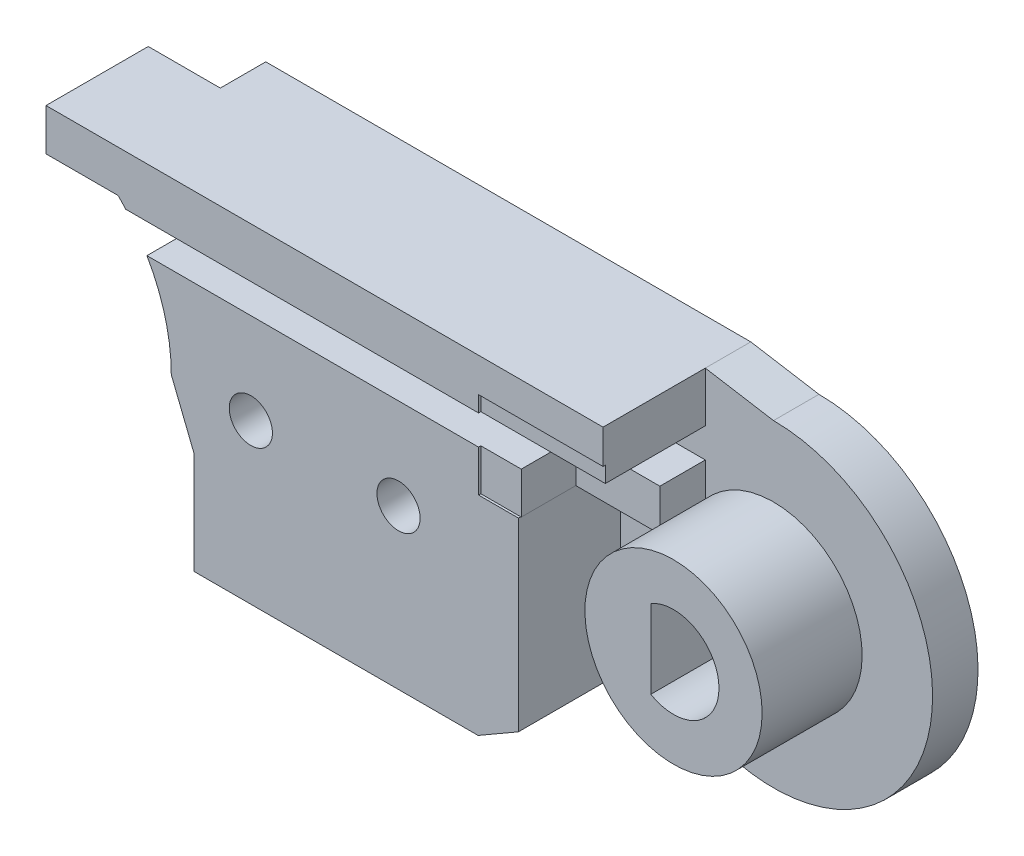
ISO-10303-21;
HEADER;
FILE_DESCRIPTION(('STEP AP214'),'2;1');
FILE_NAME('part.step','',(''),(''),'','','');
FILE_SCHEMA(('AUTOMOTIVE_DESIGN { 1 0 10303 214 1 1 1 1 }'));
ENDSEC;
DATA;
#1=APPLICATION_CONTEXT('core data for automotive mechanical design processes');
#2=APPLICATION_PROTOCOL_DEFINITION('international standard','automotive_design',2000,#1);
#3=PRODUCT_CONTEXT('',#1,'mechanical');
#4=PRODUCT('Part','Part','',(#3));
#5=PRODUCT_RELATED_PRODUCT_CATEGORY('part','',(#4));
#6=PRODUCT_DEFINITION_FORMATION('','',#4);
#7=PRODUCT_DEFINITION_CONTEXT('part definition',#1,'design');
#8=PRODUCT_DEFINITION('design','',#6,#7);
#9=PRODUCT_DEFINITION_SHAPE('','',#8);
#10=(LENGTH_UNIT() NAMED_UNIT(*) SI_UNIT(.MILLI.,.METRE.));
#11=(NAMED_UNIT(*) PLANE_ANGLE_UNIT() SI_UNIT($,.RADIAN.));
#12=(NAMED_UNIT(*) SI_UNIT($,.STERADIAN.) SOLID_ANGLE_UNIT());
#13=UNCERTAINTY_MEASURE_WITH_UNIT(LENGTH_MEASURE(1.E-05),#10,'distance_accuracy_value','');
#14=(GEOMETRIC_REPRESENTATION_CONTEXT(3) GLOBAL_UNCERTAINTY_ASSIGNED_CONTEXT((#13)) GLOBAL_UNIT_ASSIGNED_CONTEXT((#10,
#11,#12)) REPRESENTATION_CONTEXT('',''));
#15=CARTESIAN_POINT('',(0.,0.,0.));
#16=DIRECTION('',(0.,0.,1.));
#17=DIRECTION('',(1.,0.,0.));
#18=AXIS2_PLACEMENT_3D('',#15,#16,#17);
#19=CARTESIAN_POINT('',(0.,0.,6.5));
#20=DIRECTION('',(0.,0.,1.));
#21=DIRECTION('',(1.,0.,0.));
#22=AXIS2_PLACEMENT_3D('',#19,#20,#21);
#23=PLANE('',#22);
#24=DIRECTION('',(0.,-1.,0.));
#25=VECTOR('',#24,1.);
#26=CARTESIAN_POINT('',(21.5203540034992,0.,6.5));
#27=LINE('',#26,#25);
#28=CARTESIAN_POINT('',(21.5203540034992,6.,6.5));
#29=VERTEX_POINT('',#28);
#30=CARTESIAN_POINT('',(21.5203540034992,5.3,6.5));
#31=VERTEX_POINT('',#30);
#32=EDGE_CURVE('E341',#29,#31,#27,.T.);
#33=ORIENTED_EDGE('',*,*,#32,.F.);
#34=DIRECTION('',(-1.,0.,0.));
#35=VECTOR('',#34,1.);
#36=CARTESIAN_POINT('',(0.,6.,6.5));
#37=LINE('',#36,#35);
#38=CARTESIAN_POINT('',(27.,6.,6.5));
#39=VERTEX_POINT('',#38);
#40=EDGE_CURVE('E52',#39,#29,#37,.T.);
#41=ORIENTED_EDGE('',*,*,#40,.F.);
#42=DIRECTION('',(0.,1.,0.));
#43=VECTOR('',#42,1.);
#44=CARTESIAN_POINT('',(27.,7.5,6.5));
#45=LINE('',#44,#43);
#46=CARTESIAN_POINT('',(27.,7.5,6.5));
#47=VERTEX_POINT('',#46);
#48=EDGE_CURVE('E401',#39,#47,#45,.T.);
#49=ORIENTED_EDGE('',*,*,#48,.T.);
#50=DIRECTION('',(-1.,0.,0.));
#51=VECTOR('',#50,1.);
#52=CARTESIAN_POINT('',(21.5,7.5,6.5));
#53=LINE('',#52,#51);
#54=CARTESIAN_POINT('',(2.48679014755027,7.5,6.5));
#55=VERTEX_POINT('',#54);
#56=EDGE_CURVE('E404',#47,#55,#53,.T.);
#57=ORIENTED_EDGE('',*,*,#56,.T.);
#58=DIRECTION('',(0.,-1.,0.));
#59=VECTOR('',#58,1.);
#60=CARTESIAN_POINT('',(2.48679014755027,7.5,6.5));
#61=LINE('',#60,#59);
#62=CARTESIAN_POINT('',(2.48679014755027,5.65685424949238,6.5));
#63=VERTEX_POINT('',#62);
#64=EDGE_CURVE('E407',#55,#63,#61,.T.);
#65=ORIENTED_EDGE('',*,*,#64,.T.);
#66=DIRECTION('',(1.,0.,0.));
#67=VECTOR('',#66,1.);
#68=CARTESIAN_POINT('',(5.65685424949238,5.65685424949238,6.5));
#69=LINE('',#68,#67);
#70=CARTESIAN_POINT('',(5.65685424949238,5.65685424949238,6.5));
#71=VERTEX_POINT('',#70);
#72=EDGE_CURVE('E410',#63,#71,#69,.T.);
#73=ORIENTED_EDGE('',*,*,#72,.T.);
#74=CARTESIAN_POINT('',(0.,0.,6.5));
#75=DIRECTION('',(0.,0.,-1.));
#76=DIRECTION('',(1.,0.,0.));
#77=AXIS2_PLACEMENT_3D('',#74,#75,#76);
#78=CIRCLE('',#77,8.);
#79=CARTESIAN_POINT('',(5.99249530663145,5.3,6.5));
#80=VERTEX_POINT('',#79);
#81=EDGE_CURVE('E377',#71,#80,#78,.T.);
#82=ORIENTED_EDGE('',*,*,#81,.T.);
#83=DIRECTION('',(-1.,0.,0.));
#84=VECTOR('',#83,1.);
#85=CARTESIAN_POINT('',(18.0980804477077,5.3,6.5));
#86=LINE('',#85,#84);
#87=EDGE_CURVE('E348',#31,#80,#86,.T.);
#88=ORIENTED_EDGE('',*,*,#87,.F.);
#89=EDGE_LOOP('',(#33,#41,#49,#57,#65,#73,#82,#88));
#90=FACE_BOUND('',#89,.T.);
#91=ADVANCED_FACE('F42',(#90),#23,.T.);
#92=CARTESIAN_POINT('',(30.,0.,6.4));
#93=DIRECTION('',(0.,0.,1.));
#94=DIRECTION('',(1.,0.,0.));
#95=AXIS2_PLACEMENT_3D('',#92,#93,#94);
#96=PLANE('',#95);
#97=CARTESIAN_POINT('',(30.,0.,6.4));
#98=DIRECTION('',(0.,0.,1.));
#99=DIRECTION('',(1.,0.,0.));
#100=AXIS2_PLACEMENT_3D('',#97,#98,#99);
#101=CIRCLE('',#100,1.99999999999999);
#102=CARTESIAN_POINT('',(29.,-1.73205080756886,6.4));
#103=VERTEX_POINT('',#102);
#104=CARTESIAN_POINT('',(29.,1.73205080756886,6.4));
#105=VERTEX_POINT('',#104);
#106=EDGE_CURVE('E65',#103,#105,#101,.T.);
#107=ORIENTED_EDGE('',*,*,#106,.F.);
#108=DIRECTION('',(0.,-1.,0.));
#109=VECTOR('',#108,1.);
#110=CARTESIAN_POINT('',(29.,1.73205080756886,6.4));
#111=LINE('',#110,#109);
#112=EDGE_CURVE('E253',#105,#103,#111,.T.);
#113=ORIENTED_EDGE('',*,*,#112,.F.);
#114=EDGE_LOOP('',(#107,#113));
#115=FACE_BOUND('',#114,.T.);
#116=CARTESIAN_POINT('',(30.,0.,6.4));
#117=DIRECTION('',(0.,0.,1.));
#118=DIRECTION('',(1.,0.,0.));
#119=AXIS2_PLACEMENT_3D('',#116,#117,#118);
#120=CIRCLE('',#119,3.89999999999999);
#121=CARTESIAN_POINT('',(33.9,0.,6.4));
#122=VERTEX_POINT('',#121);
#123=EDGE_CURVE('E266',#122,#122,#120,.T.);
#124=ORIENTED_EDGE('',*,*,#123,.T.);
#125=EDGE_LOOP('',(#124));
#126=FACE_BOUND('',#125,.T.);
#127=ADVANCED_FACE('F719',(#115,#126),#96,.T.);
#128=CARTESIAN_POINT('',(30.,0.,0.));
#129=DIRECTION('',(0.,0.,1.));
#130=DIRECTION('',(1.,0.,0.));
#131=AXIS2_PLACEMENT_3D('',#128,#129,#130);
#132=CYLINDRICAL_SURFACE('',#131,1.99999999999999);
#133=ORIENTED_EDGE('',*,*,#106,.T.);
#134=DIRECTION('',(0.,0.,1.));
#135=VECTOR('',#134,1.);
#136=CARTESIAN_POINT('',(29.,1.73205080756886,0.));
#137=LINE('',#136,#135);
#138=CARTESIAN_POINT('',(29.,1.73205080756886,0.));
#139=VERTEX_POINT('',#138);
#140=EDGE_CURVE('E235',#139,#105,#137,.T.);
#141=ORIENTED_EDGE('',*,*,#140,.F.);
#142=CARTESIAN_POINT('',(30.,0.,0.));
#143=DIRECTION('',(0.,0.,1.));
#144=DIRECTION('',(1.,0.,0.));
#145=AXIS2_PLACEMENT_3D('',#142,#143,#144);
#146=CIRCLE('',#145,1.99999999999999);
#147=CARTESIAN_POINT('',(29.,-1.73205080756886,0.));
#148=VERTEX_POINT('',#147);
#149=EDGE_CURVE('E60',#148,#139,#146,.T.);
#150=ORIENTED_EDGE('',*,*,#149,.F.);
#151=DIRECTION('',(0.,0.,1.));
#152=VECTOR('',#151,1.);
#153=CARTESIAN_POINT('',(29.,-1.73205080756886,0.));
#154=LINE('',#153,#152);
#155=EDGE_CURVE('E242',#148,#103,#154,.T.);
#156=ORIENTED_EDGE('',*,*,#155,.T.);
#157=EDGE_LOOP('',(#133,#141,#150,#156));
#158=FACE_BOUND('',#157,.T.);
#159=ADVANCED_FACE('F237',(#158),#132,.F.);
#160=CARTESIAN_POINT('',(29.,1.73205080756886,0.));
#161=DIRECTION('',(-1.,0.,0.));
#162=DIRECTION('',(0.,0.,1.));
#163=AXIS2_PLACEMENT_3D('',#160,#161,#162);
#164=PLANE('',#163);
#165=ORIENTED_EDGE('',*,*,#112,.T.);
#166=ORIENTED_EDGE('',*,*,#155,.F.);
#167=DIRECTION('',(0.,-1.,0.));
#168=VECTOR('',#167,1.);
#169=CARTESIAN_POINT('',(29.,1.73205080756886,0.));
#170=LINE('',#169,#168);
#171=EDGE_CURVE('E243',#139,#148,#170,.T.);
#172=ORIENTED_EDGE('',*,*,#171,.F.);
#173=ORIENTED_EDGE('',*,*,#140,.T.);
#174=EDGE_LOOP('',(#165,#166,#172,#173));
#175=FACE_BOUND('',#174,.T.);
#176=ADVANCED_FACE('F246',(#175),#164,.F.);
#177=CARTESIAN_POINT('',(18.,0.,4.5));
#178=DIRECTION('',(0.,0.,-1.));
#179=DIRECTION('',(-1.,0.,0.));
#180=AXIS2_PLACEMENT_3D('',#177,#178,#179);
#181=CYLINDRICAL_SURFACE('',#180,2.);
#182=CARTESIAN_POINT('',(18.,0.,4.5));
#183=DIRECTION('',(0.,0.,-1.));
#184=DIRECTION('',(-1.,0.,0.));
#185=AXIS2_PLACEMENT_3D('',#182,#183,#184);
#186=CIRCLE('',#185,2.);
#187=CARTESIAN_POINT('',(16.,0.,4.5));
#188=VERTEX_POINT('',#187);
#189=EDGE_CURVE('E563',#188,#188,#186,.T.);
#190=ORIENTED_EDGE('',*,*,#189,.F.);
#191=EDGE_LOOP('',(#190));
#192=FACE_BOUND('',#191,.T.);
#193=CARTESIAN_POINT('',(18.,0.,0.));
#194=DIRECTION('',(0.,0.,-1.));
#195=DIRECTION('',(-1.,0.,0.));
#196=AXIS2_PLACEMENT_3D('',#193,#194,#195);
#197=CIRCLE('',#196,2.);
#198=CARTESIAN_POINT('',(16.,0.,0.));
#199=VERTEX_POINT('',#198);
#200=EDGE_CURVE('E569',#199,#199,#197,.T.);
#201=ORIENTED_EDGE('',*,*,#200,.T.);
#202=EDGE_LOOP('',(#201));
#203=FACE_BOUND('',#202,.T.);
#204=ADVANCED_FACE('F910',(#192,#203),#181,.F.);
#205=CARTESIAN_POINT('',(11.5,0.,4.5));
#206=DIRECTION('',(0.,0.,-1.));
#207=DIRECTION('',(-1.,0.,0.));
#208=AXIS2_PLACEMENT_3D('',#205,#206,#207);
#209=CYLINDRICAL_SURFACE('',#208,2.);
#210=CARTESIAN_POINT('',(11.5,0.,4.5));
#211=DIRECTION('',(0.,0.,-1.));
#212=DIRECTION('',(-1.,0.,0.));
#213=AXIS2_PLACEMENT_3D('',#210,#211,#212);
#214=CIRCLE('',#213,2.);
#215=CARTESIAN_POINT('',(9.5,0.,4.5));
#216=VERTEX_POINT('',#215);
#217=EDGE_CURVE('E549',#216,#216,#214,.T.);
#218=ORIENTED_EDGE('',*,*,#217,.F.);
#219=EDGE_LOOP('',(#218));
#220=FACE_BOUND('',#219,.T.);
#221=CARTESIAN_POINT('',(11.5,0.,0.));
#222=DIRECTION('',(0.,0.,-1.));
#223=DIRECTION('',(-1.,0.,0.));
#224=AXIS2_PLACEMENT_3D('',#221,#222,#223);
#225=CIRCLE('',#224,2.);
#226=CARTESIAN_POINT('',(9.5,0.,0.));
#227=VERTEX_POINT('',#226);
#228=EDGE_CURVE('E557',#227,#227,#225,.T.);
#229=ORIENTED_EDGE('',*,*,#228,.T.);
#230=EDGE_LOOP('',(#229));
#231=FACE_BOUND('',#230,.T.);
#232=ADVANCED_FACE('F733',(#220,#231),#209,.F.);
#233=CARTESIAN_POINT('',(30.,0.,6.4));
#234=DIRECTION('',(0.,0.,-1.));
#235=DIRECTION('',(-1.,0.,0.));
#236=AXIS2_PLACEMENT_3D('',#233,#234,#235);
#237=CYLINDRICAL_SURFACE('',#236,3.89999999999999);
#238=ORIENTED_EDGE('',*,*,#123,.F.);
#239=EDGE_LOOP('',(#238));
#240=FACE_BOUND('',#239,.T.);
#241=CARTESIAN_POINT('',(30.,0.,2.));
#242=DIRECTION('',(0.,0.,1.));
#243=DIRECTION('',(1.,0.,0.));
#244=AXIS2_PLACEMENT_3D('',#241,#242,#243);
#245=CIRCLE('',#244,3.89999999999999);
#246=CARTESIAN_POINT('',(26.7608042864271,2.1720062451962,2.));
#247=VERTEX_POINT('',#246);
#248=CARTESIAN_POINT('',(27.,2.49198715887543,2.));
#249=VERTEX_POINT('',#248);
#250=EDGE_CURVE('E264',#247,#249,#245,.T.);
#251=ORIENTED_EDGE('',*,*,#250,.T.);
#252=DIRECTION('',(0.,0.,-1.));
#253=VECTOR('',#252,1.);
#254=CARTESIAN_POINT('',(27.,2.49198715887543,6.4));
#255=LINE('',#254,#253);
#256=CARTESIAN_POINT('',(27.,2.49198715887543,4.));
#257=VERTEX_POINT('',#256);
#258=EDGE_CURVE('E277',#249,#257,#255,.F.);
#259=ORIENTED_EDGE('',*,*,#258,.T.);
#260=CARTESIAN_POINT('',(30.,0.,4.));
#261=DIRECTION('',(0.,0.,-1.));
#262=DIRECTION('',(-1.,0.,0.));
#263=AXIS2_PLACEMENT_3D('',#260,#261,#262);
#264=CIRCLE('',#263,3.89999999999999);
#265=CARTESIAN_POINT('',(26.7608042864271,2.1720062451962,4.));
#266=VERTEX_POINT('',#265);
#267=EDGE_CURVE('E12',#257,#266,#264,.F.);
#268=ORIENTED_EDGE('',*,*,#267,.T.);
#269=DIRECTION('',(0.,0.,-1.));
#270=VECTOR('',#269,1.);
#271=CARTESIAN_POINT('',(26.7608042864271,2.1720062451962,6.4));
#272=LINE('',#271,#270);
#273=EDGE_CURVE('E270',#266,#247,#272,.T.);
#274=ORIENTED_EDGE('',*,*,#273,.T.);
#275=EDGE_LOOP('',(#251,#259,#268,#274));
#276=FACE_BOUND('',#275,.T.);
#277=ADVANCED_FACE('F662',(#240,#276),#237,.T.);
#278=CARTESIAN_POINT('',(30.,0.,2.));
#279=DIRECTION('',(0.,0.,-1.));
#280=DIRECTION('',(-1.,0.,0.));
#281=AXIS2_PLACEMENT_3D('',#278,#279,#280);
#282=CYLINDRICAL_SURFACE('',#281,7.);
#283=CARTESIAN_POINT('',(30.,0.,0.));
#284=DIRECTION('',(0.,0.,1.));
#285=DIRECTION('',(1.,0.,0.));
#286=AXIS2_PLACEMENT_3D('',#283,#284,#285);
#287=CIRCLE('',#286,7.);
#288=CARTESIAN_POINT('',(25.0502525316942,-4.94974746830584,0.));
#289=VERTEX_POINT('',#288);
#290=CARTESIAN_POINT('',(30.,7.00000000000001,0.));
#291=VERTEX_POINT('',#290);
#292=EDGE_CURVE('E464',#289,#291,#287,.T.);
#293=ORIENTED_EDGE('',*,*,#292,.T.);
#294=DIRECTION('',(0.,0.,-1.));
#295=VECTOR('',#294,1.);
#296=CARTESIAN_POINT('',(30.,7.00000000000001,2.));
#297=LINE('',#296,#295);
#298=CARTESIAN_POINT('',(30.,7.00000000000001,2.));
#299=VERTEX_POINT('',#298);
#300=EDGE_CURVE('E513',#299,#291,#297,.T.);
#301=ORIENTED_EDGE('',*,*,#300,.F.);
#302=CARTESIAN_POINT('',(30.,0.,2.));
#303=DIRECTION('',(0.,0.,1.));
#304=DIRECTION('',(1.,0.,0.));
#305=AXIS2_PLACEMENT_3D('',#302,#303,#304);
#306=CIRCLE('',#305,7.);
#307=CARTESIAN_POINT('',(25.0502525316942,-4.94974746830584,2.));
#308=VERTEX_POINT('',#307);
#309=EDGE_CURVE('E472',#308,#299,#306,.T.);
#310=ORIENTED_EDGE('',*,*,#309,.F.);
#311=DIRECTION('',(0.,0.,-1.));
#312=VECTOR('',#311,1.);
#313=CARTESIAN_POINT('',(25.0502525316942,-4.94974746830584,2.));
#314=LINE('',#313,#312);
#315=EDGE_CURVE('E509',#308,#289,#314,.T.);
#316=ORIENTED_EDGE('',*,*,#315,.T.);
#317=EDGE_LOOP('',(#293,#301,#310,#316));
#318=FACE_BOUND('',#317,.T.);
#319=ADVANCED_FACE('F669',(#318),#282,.T.);
#320=CARTESIAN_POINT('',(30.,7.00000000000001,2.));
#321=DIRECTION('',(-0.164398987305353,-0.986393923832144,0.));
#322=DIRECTION('',(0.986393923832144,-0.164398987305353,0.));
#323=AXIS2_PLACEMENT_3D('',#320,#321,#322);
#324=PLANE('',#323);
#325=DIRECTION('',(-0.986393923832145,0.164398987305353,0.));
#326=VECTOR('',#325,1.);
#327=CARTESIAN_POINT('',(30.,7.00000000000001,0.));
#328=LINE('',#327,#326);
#329=CARTESIAN_POINT('',(27.,7.5,0.));
#330=VERTEX_POINT('',#329);
#331=EDGE_CURVE('E503',#291,#330,#328,.T.);
#332=ORIENTED_EDGE('',*,*,#331,.T.);
#333=DIRECTION('',(0.,0.,-1.));
#334=VECTOR('',#333,1.);
#335=CARTESIAN_POINT('',(27.,7.5,2.));
#336=LINE('',#335,#334);
#337=CARTESIAN_POINT('',(27.,7.5,2.));
#338=VERTEX_POINT('',#337);
#339=EDGE_CURVE('E517',#338,#330,#336,.T.);
#340=ORIENTED_EDGE('',*,*,#339,.F.);
#341=DIRECTION('',(-0.986393923832145,0.164398987305353,0.));
#342=VECTOR('',#341,1.);
#343=CARTESIAN_POINT('',(30.,7.00000000000001,2.));
#344=LINE('',#343,#342);
#345=EDGE_CURVE('E468',#299,#338,#344,.T.);
#346=ORIENTED_EDGE('',*,*,#345,.F.);
#347=ORIENTED_EDGE('',*,*,#300,.T.);
#348=EDGE_LOOP('',(#332,#340,#346,#347));
#349=FACE_BOUND('',#348,.T.);
#350=ADVANCED_FACE('F673',(#349),#324,.F.);
#351=CARTESIAN_POINT('',(5.65685424949238,5.65685424949238,2.));
#352=DIRECTION('',(-1.,0.,0.));
#353=DIRECTION('',(0.,0.,1.));
#354=AXIS2_PLACEMENT_3D('',#351,#352,#353);
#355=PLANE('',#354);
#356=DIRECTION('',(0.,1.,0.));
#357=VECTOR('',#356,1.);
#358=CARTESIAN_POINT('',(5.65685424949238,5.65685424949238,0.));
#359=LINE('',#358,#357);
#360=CARTESIAN_POINT('',(5.65685424949238,5.65685424949238,0.));
#361=VERTEX_POINT('',#360);
#362=CARTESIAN_POINT('',(5.65685424949238,7.5,0.));
#363=VERTEX_POINT('',#362);
#364=EDGE_CURVE('E495',#361,#363,#359,.T.);
#365=ORIENTED_EDGE('',*,*,#364,.F.);
#366=DIRECTION('',(0.,0.,-1.));
#367=VECTOR('',#366,1.);
#368=CARTESIAN_POINT('',(5.65685424949238,5.65685424949238,2.));
#369=LINE('',#368,#367);
#370=CARTESIAN_POINT('',(5.65685424949238,5.65685424949238,2.));
#371=VERTEX_POINT('',#370);
#372=EDGE_CURVE('E523',#371,#361,#369,.T.);
#373=ORIENTED_EDGE('',*,*,#372,.F.);
#374=DIRECTION('',(0.,1.,0.));
#375=VECTOR('',#374,1.);
#376=CARTESIAN_POINT('',(5.65685424949238,5.65685424949238,2.));
#377=LINE('',#376,#375);
#378=CARTESIAN_POINT('',(5.65685424949238,7.5,2.));
#379=VERTEX_POINT('',#378);
#380=EDGE_CURVE('E463',#371,#379,#377,.T.);
#381=ORIENTED_EDGE('',*,*,#380,.T.);
#382=DIRECTION('',(0.,0.,-1.));
#383=VECTOR('',#382,1.);
#384=CARTESIAN_POINT('',(5.65685424949238,7.5,2.));
#385=LINE('',#384,#383);
#386=EDGE_CURVE('E520',#379,#363,#385,.T.);
#387=ORIENTED_EDGE('',*,*,#386,.T.);
#388=EDGE_LOOP('',(#365,#373,#381,#387));
#389=FACE_BOUND('',#388,.T.);
#390=ADVANCED_FACE('F702',(#389),#355,.T.);
#391=CARTESIAN_POINT('',(8.,0.,2.));
#392=DIRECTION('',(0.928476690885259,0.371390676354104,0.));
#393=DIRECTION('',(-0.371390676354104,0.928476690885259,0.));
#394=AXIS2_PLACEMENT_3D('',#391,#392,#393);
#395=PLANE('',#394);
#396=DIRECTION('',(0.371390676354104,-0.928476690885259,0.));
#397=VECTOR('',#396,1.);
#398=CARTESIAN_POINT('',(8.,0.,0.));
#399=LINE('',#398,#397);
#400=CARTESIAN_POINT('',(8.,0.,0.));
#401=VERTEX_POINT('',#400);
#402=CARTESIAN_POINT('',(9.,-2.5,0.));
#403=VERTEX_POINT('',#402);
#404=EDGE_CURVE('E487',#401,#403,#399,.T.);
#405=ORIENTED_EDGE('',*,*,#404,.T.);
#406=DIRECTION('',(0.,0.,-1.));
#407=VECTOR('',#406,1.);
#408=CARTESIAN_POINT('',(9.,-2.5,2.));
#409=LINE('',#408,#407);
#410=CARTESIAN_POINT('',(9.,-2.5,6.5));
#411=VERTEX_POINT('',#410);
#412=EDGE_CURVE('E529',#411,#403,#409,.T.);
#413=ORIENTED_EDGE('',*,*,#412,.F.);
#414=DIRECTION('',(0.371390676354105,-0.928476690885259,0.));
#415=VECTOR('',#414,1.);
#416=CARTESIAN_POINT('',(8.,0.,6.5));
#417=LINE('',#416,#415);
#418=CARTESIAN_POINT('',(8.,0.,6.5));
#419=VERTEX_POINT('',#418);
#420=EDGE_CURVE('E381',#419,#411,#417,.T.);
#421=ORIENTED_EDGE('',*,*,#420,.F.);
#422=DIRECTION('',(0.,0.,-1.));
#423=VECTOR('',#422,1.);
#424=CARTESIAN_POINT('',(8.,0.,2.));
#425=LINE('',#424,#423);
#426=EDGE_CURVE('E526',#419,#401,#425,.T.);
#427=ORIENTED_EDGE('',*,*,#426,.T.);
#428=EDGE_LOOP('',(#405,#413,#421,#427));
#429=FACE_BOUND('',#428,.T.);
#430=ADVANCED_FACE('F618',(#429),#395,.F.);
#431=CARTESIAN_POINT('',(9.,-6.99999999999999,2.));
#432=DIRECTION('',(-1.,0.,0.));
#433=DIRECTION('',(0.,0.,1.));
#434=AXIS2_PLACEMENT_3D('',#431,#432,#433);
#435=PLANE('',#434);
#436=DIRECTION('',(0.,1.,0.));
#437=VECTOR('',#436,1.);
#438=CARTESIAN_POINT('',(9.,-6.99999999999999,0.));
#439=LINE('',#438,#437);
#440=CARTESIAN_POINT('',(9.,-6.99999999999999,0.));
#441=VERTEX_POINT('',#440);
#442=EDGE_CURVE('E483',#441,#403,#439,.T.);
#443=ORIENTED_EDGE('',*,*,#442,.F.);
#444=DIRECTION('',(0.,0.,-1.));
#445=VECTOR('',#444,1.);
#446=CARTESIAN_POINT('',(9.,-6.99999999999999,2.));
#447=LINE('',#446,#445);
#448=CARTESIAN_POINT('',(9.,-6.99999999999999,6.5));
#449=VERTEX_POINT('',#448);
#450=EDGE_CURVE('E532',#449,#441,#447,.T.);
#451=ORIENTED_EDGE('',*,*,#450,.F.);
#452=DIRECTION('',(0.,-1.,0.));
#453=VECTOR('',#452,1.);
#454=CARTESIAN_POINT('',(9.,-2.5,6.5));
#455=LINE('',#454,#453);
#456=EDGE_CURVE('E386',#411,#449,#455,.T.);
#457=ORIENTED_EDGE('',*,*,#456,.F.);
#458=ORIENTED_EDGE('',*,*,#412,.T.);
#459=EDGE_LOOP('',(#443,#451,#457,#458));
#460=FACE_BOUND('',#459,.T.);
#461=ADVANCED_FACE('F621',(#460),#435,.T.);
#462=CARTESIAN_POINT('',(25.0502525316942,-4.94974746830585,2.));
#463=DIRECTION('',(0.500093895229062,-0.865971186561437,0.));
#464=DIRECTION('',(0.865971186561437,0.500093895229062,0.));
#465=AXIS2_PLACEMENT_3D('',#462,#463,#464);
#466=PLANE('',#465);
#467=DIRECTION('',(-0.865971186561437,-0.500093895229062,0.));
#468=VECTOR('',#467,1.);
#469=CARTESIAN_POINT('',(25.0502525316942,-4.94974746830585,0.));
#470=LINE('',#469,#468);
#471=CARTESIAN_POINT('',(21.5,-6.99999999999999,0.));
#472=VERTEX_POINT('',#471);
#473=EDGE_CURVE('E458',#289,#472,#470,.T.);
#474=ORIENTED_EDGE('',*,*,#473,.F.);
#475=ORIENTED_EDGE('',*,*,#315,.F.);
#476=DIRECTION('',(-0.865971186561437,-0.500093895229062,0.));
#477=VECTOR('',#476,1.);
#478=CARTESIAN_POINT('',(25.0502525316942,-4.94974746830585,2.));
#479=LINE('',#478,#477);
#480=CARTESIAN_POINT('',(23.2751262658471,-5.97487373415292,2.));
#481=VERTEX_POINT('',#480);
#482=EDGE_CURVE('E459',#308,#481,#479,.T.);
#483=ORIENTED_EDGE('',*,*,#482,.T.);
#484=DIRECTION('',(0.,0.,-1.));
#485=VECTOR('',#484,1.);
#486=CARTESIAN_POINT('',(23.2751262658471,-5.97487373415292,6.5));
#487=LINE('',#486,#485);
#488=CARTESIAN_POINT('',(23.2751262658471,-5.97487373415292,6.5));
#489=VERTEX_POINT('',#488);
#490=EDGE_CURVE('E454',#489,#481,#487,.T.);
#491=ORIENTED_EDGE('',*,*,#490,.F.);
#492=DIRECTION('',(0.865971186561437,0.500093895229063,0.));
#493=VECTOR('',#492,1.);
#494=CARTESIAN_POINT('',(21.5,-6.99999999999999,6.5));
#495=LINE('',#494,#493);
#496=CARTESIAN_POINT('',(21.5,-6.99999999999999,6.5));
#497=VERTEX_POINT('',#496);
#498=EDGE_CURVE('E394',#497,#489,#495,.T.);
#499=ORIENTED_EDGE('',*,*,#498,.F.);
#500=DIRECTION('',(0.,0.,-1.));
#501=VECTOR('',#500,1.);
#502=CARTESIAN_POINT('',(21.5,-6.99999999999999,2.));
#503=LINE('',#502,#501);
#504=EDGE_CURVE('E475',#497,#472,#503,.T.);
#505=ORIENTED_EDGE('',*,*,#504,.T.);
#506=EDGE_LOOP('',(#474,#475,#483,#491,#499,#505));
#507=FACE_BOUND('',#506,.T.);
#508=ADVANCED_FACE('F44',(#507),#466,.T.);
#509=CARTESIAN_POINT('',(27.,2.1720062451962,6.5));
#510=DIRECTION('',(0.,1.,0.));
#511=DIRECTION('',(0.,0.,1.));
#512=AXIS2_PLACEMENT_3D('',#509,#510,#511);
#513=PLANE('',#512);
#514=ORIENTED_EDGE('',*,*,#273,.F.);
#515=DIRECTION('',(1.,0.,0.));
#516=VECTOR('',#515,1.);
#517=CARTESIAN_POINT('',(27.,2.1720062451962,4.));
#518=LINE('',#517,#516);
#519=CARTESIAN_POINT('',(23.3,2.1720062451962,4.));
#520=VERTEX_POINT('',#519);
#521=EDGE_CURVE('E282',#520,#266,#518,.T.);
#522=ORIENTED_EDGE('',*,*,#521,.F.);
#523=DIRECTION('',(0.,0.,1.));
#524=VECTOR('',#523,1.);
#525=CARTESIAN_POINT('',(23.3,2.1720062451962,4.));
#526=LINE('',#525,#524);
#527=CARTESIAN_POINT('',(23.3,2.1720062451962,6.4));
#528=VERTEX_POINT('',#527);
#529=EDGE_CURVE('E298',#520,#528,#526,.T.);
#530=ORIENTED_EDGE('',*,*,#529,.T.);
#531=DIRECTION('',(1.,0.,0.));
#532=VECTOR('',#531,1.);
#533=CARTESIAN_POINT('',(27.,2.1720062451962,6.4));
#534=LINE('',#533,#532);
#535=CARTESIAN_POINT('',(23.2751262658471,2.1720062451962,6.4));
#536=VERTEX_POINT('',#535);
#537=EDGE_CURVE('E302',#536,#528,#534,.T.);
#538=ORIENTED_EDGE('',*,*,#537,.F.);
#539=DIRECTION('',(0.,0.,-1.));
#540=VECTOR('',#539,1.);
#541=CARTESIAN_POINT('',(23.2751262658471,2.1720062451962,6.5));
#542=LINE('',#541,#540);
#543=CARTESIAN_POINT('',(23.2751262658471,2.1720062451962,2.));
#544=VERTEX_POINT('',#543);
#545=EDGE_CURVE('E450',#536,#544,#542,.T.);
#546=ORIENTED_EDGE('',*,*,#545,.T.);
#547=DIRECTION('',(1.,0.,0.));
#548=VECTOR('',#547,1.);
#549=CARTESIAN_POINT('',(27.,2.1720062451962,2.));
#550=LINE('',#549,#548);
#551=EDGE_CURVE('E417',#544,#247,#550,.T.);
#552=ORIENTED_EDGE('',*,*,#551,.T.);
#553=EDGE_LOOP('',(#514,#522,#530,#538,#546,#552));
#554=FACE_BOUND('',#553,.T.);
#555=ADVANCED_FACE('F646',(#554),#513,.F.);
#556=CARTESIAN_POINT('',(5.65685424949238,7.5,2.));
#557=DIRECTION('',(0.,1.,0.));
#558=DIRECTION('',(-1.,0.,0.));
#559=AXIS2_PLACEMENT_3D('',#556,#557,#558);
#560=PLANE('',#559);
#561=DIRECTION('',(1.,0.,0.));
#562=VECTOR('',#561,1.);
#563=CARTESIAN_POINT('',(5.65685424949238,7.5,0.));
#564=LINE('',#563,#562);
#565=EDGE_CURVE('E499',#363,#330,#564,.T.);
#566=ORIENTED_EDGE('',*,*,#565,.F.);
#567=ORIENTED_EDGE('',*,*,#386,.F.);
#568=DIRECTION('',(-1.,0.,0.));
#569=VECTOR('',#568,1.);
#570=CARTESIAN_POINT('',(5.65685424949238,7.5,2.));
#571=LINE('',#570,#569);
#572=CARTESIAN_POINT('',(2.48679014755027,7.5,2.));
#573=VERTEX_POINT('',#572);
#574=EDGE_CURVE('E425',#379,#573,#571,.T.);
#575=ORIENTED_EDGE('',*,*,#574,.T.);
#576=DIRECTION('',(0.,0.,-1.));
#577=VECTOR('',#576,1.);
#578=CARTESIAN_POINT('',(2.48679014755027,7.5,6.5));
#579=LINE('',#578,#577);
#580=EDGE_CURVE('E442',#55,#573,#579,.T.);
#581=ORIENTED_EDGE('',*,*,#580,.F.);
#582=ORIENTED_EDGE('',*,*,#56,.F.);
#583=DIRECTION('',(0.,0.,-1.));
#584=VECTOR('',#583,1.);
#585=CARTESIAN_POINT('',(27.,7.5,6.5));
#586=LINE('',#585,#584);
#587=EDGE_CURVE('E446',#47,#338,#586,.T.);
#588=ORIENTED_EDGE('',*,*,#587,.T.);
#589=ORIENTED_EDGE('',*,*,#339,.T.);
#590=EDGE_LOOP('',(#566,#567,#575,#581,#582,#588,#589));
#591=FACE_BOUND('',#590,.T.);
#592=ADVANCED_FACE('F678',(#591),#560,.T.);
#593=CARTESIAN_POINT('',(2.48679014755027,7.5,6.5));
#594=DIRECTION('',(1.,0.,0.));
#595=DIRECTION('',(0.,0.,-1.));
#596=AXIS2_PLACEMENT_3D('',#593,#594,#595);
#597=PLANE('',#596);
#598=DIRECTION('',(0.,-1.,0.));
#599=VECTOR('',#598,1.);
#600=CARTESIAN_POINT('',(2.48679014755027,7.5,2.));
#601=LINE('',#600,#599);
#602=CARTESIAN_POINT('',(2.48679014755027,5.65685424949238,2.));
#603=VERTEX_POINT('',#602);
#604=EDGE_CURVE('E428',#573,#603,#601,.T.);
#605=ORIENTED_EDGE('',*,*,#604,.T.);
#606=DIRECTION('',(0.,0.,-1.));
#607=VECTOR('',#606,1.);
#608=CARTESIAN_POINT('',(2.48679014755027,5.65685424949238,6.5));
#609=LINE('',#608,#607);
#610=EDGE_CURVE('E438',#63,#603,#609,.T.);
#611=ORIENTED_EDGE('',*,*,#610,.F.);
#612=ORIENTED_EDGE('',*,*,#64,.F.);
#613=ORIENTED_EDGE('',*,*,#580,.T.);
#614=EDGE_LOOP('',(#605,#611,#612,#613));
#615=FACE_BOUND('',#614,.T.);
#616=ADVANCED_FACE('F708',(#615),#597,.F.);
#617=CARTESIAN_POINT('',(0.,0.,2.));
#618=DIRECTION('',(0.,0.,-1.));
#619=DIRECTION('',(-1.,0.,0.));
#620=AXIS2_PLACEMENT_3D('',#617,#618,#619);
#621=CYLINDRICAL_SURFACE('',#620,8.);
#622=CARTESIAN_POINT('',(0.,0.,2.));
#623=DIRECTION('',(0.,0.,-1.));
#624=DIRECTION('',(-1.,0.,0.));
#625=AXIS2_PLACEMENT_3D('',#622,#623,#624);
#626=CIRCLE('',#625,8.);
#627=CARTESIAN_POINT('',(5.99249530663146,5.3,2.));
#628=VERTEX_POINT('',#627);
#629=CARTESIAN_POINT('',(6.92820323027551,4.,2.));
#630=VERTEX_POINT('',#629);
#631=EDGE_CURVE('E373',#628,#630,#626,.T.);
#632=ORIENTED_EDGE('',*,*,#631,.F.);
#633=DIRECTION('',(0.,0.,-1.));
#634=VECTOR('',#633,1.);
#635=CARTESIAN_POINT('',(5.99249530663146,5.3,2.));
#636=LINE('',#635,#634);
#637=EDGE_CURVE('E369',#628,#80,#636,.F.);
#638=ORIENTED_EDGE('',*,*,#637,.T.);
#639=ORIENTED_EDGE('',*,*,#81,.F.);
#640=DIRECTION('',(0.,0.,-1.));
#641=VECTOR('',#640,1.);
#642=CARTESIAN_POINT('',(5.65685424949238,5.65685424949238,6.5));
#643=LINE('',#642,#641);
#644=EDGE_CURVE('E413',#71,#371,#643,.T.);
#645=ORIENTED_EDGE('',*,*,#644,.T.);
#646=ORIENTED_EDGE('',*,*,#372,.T.);
#647=CARTESIAN_POINT('',(0.,0.,0.));
#648=DIRECTION('',(0.,0.,1.));
#649=DIRECTION('',(1.,0.,0.));
#650=AXIS2_PLACEMENT_3D('',#647,#648,#649);
#651=CIRCLE('',#650,8.);
#652=EDGE_CURVE('E491',#401,#361,#651,.T.);
#653=ORIENTED_EDGE('',*,*,#652,.F.);
#654=ORIENTED_EDGE('',*,*,#426,.F.);
#655=CARTESIAN_POINT('',(6.92820323027551,4.,6.5));
#656=VERTEX_POINT('',#655);
#657=EDGE_CURVE('E382',#656,#419,#78,.T.);
#658=ORIENTED_EDGE('',*,*,#657,.F.);
#659=DIRECTION('',(0.,0.,-1.));
#660=VECTOR('',#659,1.);
#661=CARTESIAN_POINT('',(6.92820323027551,4.,2.));
#662=LINE('',#661,#660);
#663=EDGE_CURVE('E365',#656,#630,#662,.T.);
#664=ORIENTED_EDGE('',*,*,#663,.T.);
#665=EDGE_LOOP('',(#632,#638,#639,#645,#646,#653,#654,#658,#664));
#666=FACE_BOUND('',#665,.T.);
#667=ADVANCED_FACE('F615',(#666),#621,.F.);
#668=CARTESIAN_POINT('',(0.,0.,2.));
#669=DIRECTION('',(0.,0.,1.));
#670=DIRECTION('',(1.,0.,0.));
#671=AXIS2_PLACEMENT_3D('',#668,#669,#670);
#672=PLANE('',#671);
#673=DIRECTION('',(0.,1.,0.));
#674=VECTOR('',#673,1.);
#675=CARTESIAN_POINT('',(27.,7.5,2.));
#676=LINE('',#675,#674);
#677=CARTESIAN_POINT('',(27.,4.,2.));
#678=VERTEX_POINT('',#677);
#679=EDGE_CURVE('E422',#249,#678,#676,.T.);
#680=ORIENTED_EDGE('',*,*,#679,.F.);
#681=ORIENTED_EDGE('',*,*,#250,.F.);
#682=ORIENTED_EDGE('',*,*,#551,.F.);
#683=DIRECTION('',(0.,1.,0.));
#684=VECTOR('',#683,1.);
#685=CARTESIAN_POINT('',(23.2751262658471,-5.97487373415292,2.));
#686=LINE('',#685,#684);
#687=EDGE_CURVE('E376',#481,#544,#686,.T.);
#688=ORIENTED_EDGE('',*,*,#687,.F.);
#689=ORIENTED_EDGE('',*,*,#482,.F.);
#690=ORIENTED_EDGE('',*,*,#309,.T.);
#691=ORIENTED_EDGE('',*,*,#345,.T.);
#692=CARTESIAN_POINT('',(27.,5.3,2.));
#693=VERTEX_POINT('',#692);
#694=EDGE_CURVE('E421',#693,#338,#676,.T.);
#695=ORIENTED_EDGE('',*,*,#694,.F.);
#696=DIRECTION('',(-1.,0.,0.));
#697=VECTOR('',#696,1.);
#698=CARTESIAN_POINT('',(18.0980804477077,5.3,2.));
#699=LINE('',#698,#697);
#700=EDGE_CURVE('E347',#693,#628,#699,.T.);
#701=ORIENTED_EDGE('',*,*,#700,.T.);
#702=ORIENTED_EDGE('',*,*,#631,.T.);
#703=DIRECTION('',(1.,0.,0.));
#704=VECTOR('',#703,1.);
#705=CARTESIAN_POINT('',(27.,4.,2.));
#706=LINE('',#705,#704);
#707=EDGE_CURVE('E352',#630,#678,#706,.T.);
#708=ORIENTED_EDGE('',*,*,#707,.T.);
#709=EDGE_LOOP('',(#680,#681,#682,#688,#689,#690,#691,#695,#701,#702,#708));
#710=FACE_BOUND('',#709,.T.);
#711=ADVANCED_FACE('F660',(#710),#672,.T.);
#712=CARTESIAN_POINT('',(27.,7.5,6.5));
#713=DIRECTION('',(-1.,0.,0.));
#714=DIRECTION('',(0.,0.,1.));
#715=AXIS2_PLACEMENT_3D('',#712,#713,#714);
#716=PLANE('',#715);
#717=ORIENTED_EDGE('',*,*,#258,.F.);
#718=ORIENTED_EDGE('',*,*,#679,.T.);
#719=DIRECTION('',(0.,0.,-1.));
#720=VECTOR('',#719,1.);
#721=CARTESIAN_POINT('',(27.,4.,6.5));
#722=LINE('',#721,#720);
#723=CARTESIAN_POINT('',(27.,4.,4.));
#724=VERTEX_POINT('',#723);
#725=EDGE_CURVE('E361',#724,#678,#722,.T.);
#726=ORIENTED_EDGE('',*,*,#725,.F.);
#727=DIRECTION('',(0.,1.,0.));
#728=VECTOR('',#727,1.);
#729=CARTESIAN_POINT('',(27.,2.1720062451962,4.));
#730=LINE('',#729,#728);
#731=EDGE_CURVE('E285',#257,#724,#730,.T.);
#732=ORIENTED_EDGE('',*,*,#731,.F.);
#733=EDGE_LOOP('',(#717,#718,#726,#732));
#734=FACE_BOUND('',#733,.T.);
#735=ADVANCED_FACE('F657',(#734),#716,.F.);
#736=CARTESIAN_POINT('',(0.,0.,4.));
#737=DIRECTION('',(0.,0.,-1.));
#738=DIRECTION('',(-1.,0.,0.));
#739=AXIS2_PLACEMENT_3D('',#736,#737,#738);
#740=PLANE('',#739);
#741=ORIENTED_EDGE('',*,*,#267,.F.);
#742=ORIENTED_EDGE('',*,*,#731,.T.);
#743=DIRECTION('',(-1.,0.,0.));
#744=VECTOR('',#743,1.);
#745=CARTESIAN_POINT('',(27.,4.,4.));
#746=LINE('',#745,#744);
#747=CARTESIAN_POINT('',(23.3,4.,4.));
#748=VERTEX_POINT('',#747);
#749=EDGE_CURVE('E288',#724,#748,#746,.T.);
#750=ORIENTED_EDGE('',*,*,#749,.T.);
#751=DIRECTION('',(0.,-1.,0.));
#752=VECTOR('',#751,1.);
#753=CARTESIAN_POINT('',(23.3,2.1720062451962,4.));
#754=LINE('',#753,#752);
#755=EDGE_CURVE('E291',#748,#520,#754,.T.);
#756=ORIENTED_EDGE('',*,*,#755,.T.);
#757=ORIENTED_EDGE('',*,*,#521,.T.);
#758=EDGE_LOOP('',(#741,#742,#750,#756,#757));
#759=FACE_BOUND('',#758,.T.);
#760=ADVANCED_FACE('F652',(#759),#740,.F.);
#761=CARTESIAN_POINT('',(23.3,2.1720062451962,4.));
#762=DIRECTION('',(-1.,0.,0.));
#763=DIRECTION('',(0.,0.,1.));
#764=AXIS2_PLACEMENT_3D('',#761,#762,#763);
#765=PLANE('',#764);
#766=DIRECTION('',(0.,-1.,0.));
#767=VECTOR('',#766,1.);
#768=CARTESIAN_POINT('',(23.3,2.1720062451962,6.4));
#769=LINE('',#768,#767);
#770=CARTESIAN_POINT('',(23.3,4.,6.4));
#771=VERTEX_POINT('',#770);
#772=EDGE_CURVE('E281',#771,#528,#769,.T.);
#773=ORIENTED_EDGE('',*,*,#772,.T.);
#774=ORIENTED_EDGE('',*,*,#529,.F.);
#775=ORIENTED_EDGE('',*,*,#755,.F.);
#776=DIRECTION('',(0.,0.,1.));
#777=VECTOR('',#776,1.);
#778=CARTESIAN_POINT('',(23.3,4.,4.));
#779=LINE('',#778,#777);
#780=EDGE_CURVE('E295',#748,#771,#779,.T.);
#781=ORIENTED_EDGE('',*,*,#780,.T.);
#782=EDGE_LOOP('',(#773,#774,#775,#781));
#783=FACE_BOUND('',#782,.T.);
#784=ADVANCED_FACE('F650',(#783),#765,.F.);
#785=CARTESIAN_POINT('',(27.,4.,6.5));
#786=DIRECTION('',(0.,1.,0.));
#787=DIRECTION('',(0.,0.,1.));
#788=AXIS2_PLACEMENT_3D('',#785,#786,#787);
#789=PLANE('',#788);
#790=ORIENTED_EDGE('',*,*,#780,.F.);
#791=ORIENTED_EDGE('',*,*,#749,.F.);
#792=ORIENTED_EDGE('',*,*,#725,.T.);
#793=ORIENTED_EDGE('',*,*,#707,.F.);
#794=ORIENTED_EDGE('',*,*,#663,.F.);
#795=DIRECTION('',(-1.,0.,0.));
#796=VECTOR('',#795,1.);
#797=CARTESIAN_POINT('',(0.,4.,6.5));
#798=LINE('',#797,#796);
#799=CARTESIAN_POINT('',(21.5203540034992,4.,6.5));
#800=VERTEX_POINT('',#799);
#801=EDGE_CURVE('E512',#800,#656,#798,.T.);
#802=ORIENTED_EDGE('',*,*,#801,.F.);
#803=DIRECTION('',(0.,0.,1.));
#804=VECTOR('',#803,1.);
#805=CARTESIAN_POINT('',(21.5203540034992,4.,6.5));
#806=LINE('',#805,#804);
#807=CARTESIAN_POINT('',(21.5203540034992,4.,6.4));
#808=VERTEX_POINT('',#807);
#809=EDGE_CURVE('E542',#808,#800,#806,.T.);
#810=ORIENTED_EDGE('',*,*,#809,.F.);
#811=DIRECTION('',(-1.,0.,0.));
#812=VECTOR('',#811,1.);
#813=CARTESIAN_POINT('',(27.,4.,6.4));
#814=LINE('',#813,#812);
#815=EDGE_CURVE('E539',#771,#808,#814,.T.);
#816=ORIENTED_EDGE('',*,*,#815,.F.);
#817=EDGE_LOOP('',(#790,#791,#792,#793,#794,#802,#810,#816));
#818=FACE_BOUND('',#817,.T.);
#819=ADVANCED_FACE('F604',(#818),#789,.T.);
#820=CARTESIAN_POINT('',(21.5203540034992,2.1720062451962,6.4));
#821=DIRECTION('',(-1.,0.,0.));
#822=DIRECTION('',(0.,0.,1.));
#823=AXIS2_PLACEMENT_3D('',#820,#821,#822);
#824=PLANE('',#823);
#825=DIRECTION('',(0.,-1.,0.));
#826=VECTOR('',#825,1.);
#827=CARTESIAN_POINT('',(21.5203540034992,0.,6.5));
#828=LINE('',#827,#826);
#829=CARTESIAN_POINT('',(21.5203540034992,2.1720062451962,6.5));
#830=VERTEX_POINT('',#829);
#831=EDGE_CURVE('E334',#800,#830,#828,.T.);
#832=ORIENTED_EDGE('',*,*,#831,.T.);
#833=DIRECTION('',(0.,0.,1.));
#834=VECTOR('',#833,1.);
#835=CARTESIAN_POINT('',(21.5203540034992,2.1720062451962,6.4));
#836=LINE('',#835,#834);
#837=CARTESIAN_POINT('',(21.5203540034992,2.1720062451962,6.4));
#838=VERTEX_POINT('',#837);
#839=EDGE_CURVE('E321',#838,#830,#836,.T.);
#840=ORIENTED_EDGE('',*,*,#839,.F.);
#841=DIRECTION('',(0.,-1.,0.));
#842=VECTOR('',#841,1.);
#843=CARTESIAN_POINT('',(21.5203540034992,2.1720062451962,6.4));
#844=LINE('',#843,#842);
#845=EDGE_CURVE('E316',#808,#838,#844,.T.);
#846=ORIENTED_EDGE('',*,*,#845,.F.);
#847=ORIENTED_EDGE('',*,*,#809,.T.);
#848=EDGE_LOOP('',(#832,#840,#846,#847));
#849=FACE_BOUND('',#848,.T.);
#850=ADVANCED_FACE('F599',(#849),#824,.F.);
#851=CARTESIAN_POINT('',(0.,0.,6.4));
#852=DIRECTION('',(0.,0.,-1.));
#853=DIRECTION('',(-1.,0.,0.));
#854=AXIS2_PLACEMENT_3D('',#851,#852,#853);
#855=PLANE('',#854);
#856=ORIENTED_EDGE('',*,*,#537,.T.);
#857=ORIENTED_EDGE('',*,*,#772,.F.);
#858=ORIENTED_EDGE('',*,*,#815,.T.);
#859=ORIENTED_EDGE('',*,*,#845,.T.);
#860=EDGE_CURVE('E305',#838,#536,#534,.T.);
#861=ORIENTED_EDGE('',*,*,#860,.T.);
#862=EDGE_LOOP('',(#856,#857,#858,#859,#861));
#863=FACE_BOUND('',#862,.T.);
#864=ADVANCED_FACE('F644',(#863),#855,.F.);
#865=CARTESIAN_POINT('',(23.2751262658471,-5.97487373415292,6.5));
#866=DIRECTION('',(-1.,0.,0.));
#867=DIRECTION('',(0.,0.,1.));
#868=AXIS2_PLACEMENT_3D('',#865,#866,#867);
#869=PLANE('',#868);
#870=ORIENTED_EDGE('',*,*,#687,.T.);
#871=ORIENTED_EDGE('',*,*,#545,.F.);
#872=CARTESIAN_POINT('',(23.2751262658471,2.1720062451962,6.5));
#873=VERTEX_POINT('',#872);
#874=EDGE_CURVE('E451',#873,#536,#542,.T.);
#875=ORIENTED_EDGE('',*,*,#874,.F.);
#876=DIRECTION('',(0.,1.,0.));
#877=VECTOR('',#876,1.);
#878=CARTESIAN_POINT('',(23.2751262658471,-5.97487373415292,6.5));
#879=LINE('',#878,#877);
#880=EDGE_CURVE('E397',#489,#873,#879,.T.);
#881=ORIENTED_EDGE('',*,*,#880,.F.);
#882=ORIENTED_EDGE('',*,*,#490,.T.);
#883=EDGE_LOOP('',(#870,#871,#875,#881,#882));
#884=FACE_BOUND('',#883,.T.);
#885=ADVANCED_FACE('F632',(#884),#869,.F.);
#886=CARTESIAN_POINT('',(27.,2.1720062451962,6.4));
#887=DIRECTION('',(0.,-1.,0.));
#888=DIRECTION('',(0.,0.,-1.));
#889=AXIS2_PLACEMENT_3D('',#886,#887,#888);
#890=PLANE('',#889);
#891=DIRECTION('',(1.,0.,0.));
#892=VECTOR('',#891,1.);
#893=CARTESIAN_POINT('',(0.,2.1720062451962,6.5));
#894=LINE('',#893,#892);
#895=EDGE_CURVE('E344',#830,#873,#894,.T.);
#896=ORIENTED_EDGE('',*,*,#895,.T.);
#897=ORIENTED_EDGE('',*,*,#874,.T.);
#898=ORIENTED_EDGE('',*,*,#860,.F.);
#899=ORIENTED_EDGE('',*,*,#839,.T.);
#900=EDGE_LOOP('',(#896,#897,#898,#899));
#901=FACE_BOUND('',#900,.T.);
#902=ADVANCED_FACE('F594',(#901),#890,.F.);
#903=CARTESIAN_POINT('',(18.0980804477077,5.3,6.5));
#904=DIRECTION('',(0.,-1.,0.));
#905=DIRECTION('',(0.,0.,-1.));
#906=AXIS2_PLACEMENT_3D('',#903,#904,#905);
#907=PLANE('',#906);
#908=DIRECTION('',(0.,0.,-1.));
#909=VECTOR('',#908,1.);
#910=CARTESIAN_POINT('',(21.5203540034992,5.3,6.5));
#911=LINE('',#910,#909);
#912=CARTESIAN_POINT('',(21.5203540034992,5.3,6.4));
#913=VERTEX_POINT('',#912);
#914=EDGE_CURVE('E337',#31,#913,#911,.T.);
#915=ORIENTED_EDGE('',*,*,#914,.F.);
#916=ORIENTED_EDGE('',*,*,#87,.T.);
#917=ORIENTED_EDGE('',*,*,#637,.F.);
#918=ORIENTED_EDGE('',*,*,#700,.F.);
#919=DIRECTION('',(0.,0.,-1.));
#920=VECTOR('',#919,1.);
#921=CARTESIAN_POINT('',(27.,5.3,6.5));
#922=LINE('',#921,#920);
#923=CARTESIAN_POINT('',(27.,5.3,6.4));
#924=VERTEX_POINT('',#923);
#925=EDGE_CURVE('E351',#924,#693,#922,.T.);
#926=ORIENTED_EDGE('',*,*,#925,.F.);
#927=DIRECTION('',(1.,0.,0.));
#928=VECTOR('',#927,1.);
#929=CARTESIAN_POINT('',(18.0980804477077,5.3,6.4));
#930=LINE('',#929,#928);
#931=EDGE_CURVE('E325',#913,#924,#930,.T.);
#932=ORIENTED_EDGE('',*,*,#931,.F.);
#933=EDGE_LOOP('',(#915,#916,#917,#918,#926,#932));
#934=FACE_BOUND('',#933,.T.);
#935=ADVANCED_FACE('F751',(#934),#907,.T.);
#936=ORIENTED_EDGE('',*,*,#48,.F.);
#937=DIRECTION('',(0.,0.,1.));
#938=VECTOR('',#937,1.);
#939=CARTESIAN_POINT('',(27.,6.,6.4));
#940=LINE('',#939,#938);
#941=CARTESIAN_POINT('',(27.,6.,6.4));
#942=VERTEX_POINT('',#941);
#943=EDGE_CURVE('E320',#942,#39,#940,.T.);
#944=ORIENTED_EDGE('',*,*,#943,.F.);
#945=DIRECTION('',(0.,1.,0.));
#946=VECTOR('',#945,1.);
#947=CARTESIAN_POINT('',(27.,2.1720062451962,6.4));
#948=LINE('',#947,#946);
#949=EDGE_CURVE('E309',#924,#942,#948,.T.);
#950=ORIENTED_EDGE('',*,*,#949,.F.);
#951=ORIENTED_EDGE('',*,*,#925,.T.);
#952=ORIENTED_EDGE('',*,*,#694,.T.);
#953=ORIENTED_EDGE('',*,*,#587,.F.);
#954=EDGE_LOOP('',(#936,#944,#950,#951,#952,#953));
#955=FACE_BOUND('',#954,.T.);
#956=ADVANCED_FACE('F682',(#955),#716,.F.);
#957=ORIENTED_EDGE('',*,*,#931,.T.);
#958=ORIENTED_EDGE('',*,*,#949,.T.);
#959=DIRECTION('',(-1.,0.,0.));
#960=VECTOR('',#959,1.);
#961=CARTESIAN_POINT('',(27.,6.,6.4));
#962=LINE('',#961,#960);
#963=CARTESIAN_POINT('',(21.5203540034992,6.,6.4));
#964=VERTEX_POINT('',#963);
#965=EDGE_CURVE('E312',#942,#964,#962,.T.);
#966=ORIENTED_EDGE('',*,*,#965,.T.);
#967=EDGE_CURVE('E317',#964,#913,#844,.T.);
#968=ORIENTED_EDGE('',*,*,#967,.T.);
#969=EDGE_LOOP('',(#957,#958,#966,#968));
#970=FACE_BOUND('',#969,.T.);
#971=ADVANCED_FACE('F741',(#970),#855,.F.);
#972=ORIENTED_EDGE('',*,*,#32,.T.);
#973=ORIENTED_EDGE('',*,*,#914,.T.);
#974=ORIENTED_EDGE('',*,*,#967,.F.);
#975=DIRECTION('',(0.,0.,1.));
#976=VECTOR('',#975,1.);
#977=CARTESIAN_POINT('',(21.5203540034992,6.,6.4));
#978=LINE('',#977,#976);
#979=EDGE_CURVE('E326',#964,#29,#978,.T.);
#980=ORIENTED_EDGE('',*,*,#979,.T.);
#981=EDGE_LOOP('',(#972,#973,#974,#980));
#982=FACE_BOUND('',#981,.T.);
#983=ADVANCED_FACE('F744',(#982),#824,.F.);
#984=CARTESIAN_POINT('',(27.,6.,6.4));
#985=DIRECTION('',(0.,1.,0.));
#986=DIRECTION('',(0.,0.,1.));
#987=AXIS2_PLACEMENT_3D('',#984,#985,#986);
#988=PLANE('',#987);
#989=ORIENTED_EDGE('',*,*,#40,.T.);
#990=ORIENTED_EDGE('',*,*,#979,.F.);
#991=ORIENTED_EDGE('',*,*,#965,.F.);
#992=ORIENTED_EDGE('',*,*,#943,.T.);
#993=EDGE_LOOP('',(#989,#990,#991,#992));
#994=FACE_BOUND('',#993,.T.);
#995=ADVANCED_FACE('F745',(#994),#988,.F.);
#996=CARTESIAN_POINT('',(0.,0.,2.));
#997=DIRECTION('',(0.,0.,1.));
#998=DIRECTION('',(1.,0.,0.));
#999=AXIS2_PLACEMENT_3D('',#996,#997,#998);
#1000=PLANE('',#999);
#1001=ORIENTED_EDGE('',*,*,#380,.F.);
#1002=DIRECTION('',(1.,0.,0.));
#1003=VECTOR('',#1002,1.);
#1004=CARTESIAN_POINT('',(5.65685424949238,5.65685424949238,2.));
#1005=LINE('',#1004,#1003);
#1006=EDGE_CURVE('E431',#603,#371,#1005,.T.);
#1007=ORIENTED_EDGE('',*,*,#1006,.F.);
#1008=ORIENTED_EDGE('',*,*,#604,.F.);
#1009=ORIENTED_EDGE('',*,*,#574,.F.);
#1010=EDGE_LOOP('',(#1001,#1007,#1008,#1009));
#1011=FACE_BOUND('',#1010,.T.);
#1012=ADVANCED_FACE('F706',(#1011),#1000,.F.);
#1013=CARTESIAN_POINT('',(5.65685424949238,5.65685424949238,6.5));
#1014=DIRECTION('',(0.,1.,0.));
#1015=DIRECTION('',(0.,0.,1.));
#1016=AXIS2_PLACEMENT_3D('',#1013,#1014,#1015);
#1017=PLANE('',#1016);
#1018=ORIENTED_EDGE('',*,*,#1006,.T.);
#1019=ORIENTED_EDGE('',*,*,#644,.F.);
#1020=ORIENTED_EDGE('',*,*,#72,.F.);
#1021=ORIENTED_EDGE('',*,*,#610,.T.);
#1022=EDGE_LOOP('',(#1018,#1019,#1020,#1021));
#1023=FACE_BOUND('',#1022,.T.);
#1024=ADVANCED_FACE('F697',(#1023),#1017,.F.);
#1025=CARTESIAN_POINT('',(0.,0.,0.));
#1026=DIRECTION('',(0.,0.,1.));
#1027=DIRECTION('',(1.,0.,0.));
#1028=AXIS2_PLACEMENT_3D('',#1025,#1026,#1027);
#1029=PLANE('',#1028);
#1030=ORIENTED_EDGE('',*,*,#228,.F.);
#1031=EDGE_LOOP('',(#1030));
#1032=FACE_BOUND('',#1031,.T.);
#1033=ORIENTED_EDGE('',*,*,#200,.F.);
#1034=EDGE_LOOP('',(#1033));
#1035=FACE_BOUND('',#1034,.T.);
#1036=ORIENTED_EDGE('',*,*,#171,.T.);
#1037=ORIENTED_EDGE('',*,*,#149,.T.);
#1038=EDGE_LOOP('',(#1036,#1037));
#1039=FACE_BOUND('',#1038,.T.);
#1040=ORIENTED_EDGE('',*,*,#473,.T.);
#1041=DIRECTION('',(-1.,0.,0.));
#1042=VECTOR('',#1041,1.);
#1043=CARTESIAN_POINT('',(21.5,-6.99999999999999,0.));
#1044=LINE('',#1043,#1042);
#1045=EDGE_CURVE('E479',#472,#441,#1044,.T.);
#1046=ORIENTED_EDGE('',*,*,#1045,.T.);
#1047=ORIENTED_EDGE('',*,*,#442,.T.);
#1048=ORIENTED_EDGE('',*,*,#404,.F.);
#1049=ORIENTED_EDGE('',*,*,#652,.T.);
#1050=ORIENTED_EDGE('',*,*,#364,.T.);
#1051=ORIENTED_EDGE('',*,*,#565,.T.);
#1052=ORIENTED_EDGE('',*,*,#331,.F.);
#1053=ORIENTED_EDGE('',*,*,#292,.F.);
#1054=EDGE_LOOP('',(#1040,#1046,#1047,#1048,#1049,#1050,#1051,#1052,#1053));
#1055=FACE_BOUND('',#1054,.T.);
#1056=ADVANCED_FACE('F250',(#1032,#1035,#1039,#1055),#1029,.F.);
#1057=CARTESIAN_POINT('',(21.5,-6.99999999999999,2.));
#1058=DIRECTION('',(0.,-1.,0.));
#1059=DIRECTION('',(1.,0.,0.));
#1060=AXIS2_PLACEMENT_3D('',#1057,#1058,#1059);
#1061=PLANE('',#1060);
#1062=ORIENTED_EDGE('',*,*,#1045,.F.);
#1063=ORIENTED_EDGE('',*,*,#504,.F.);
#1064=DIRECTION('',(1.,0.,0.));
#1065=VECTOR('',#1064,1.);
#1066=CARTESIAN_POINT('',(9.,-6.99999999999999,6.5));
#1067=LINE('',#1066,#1065);
#1068=EDGE_CURVE('E390',#449,#497,#1067,.T.);
#1069=ORIENTED_EDGE('',*,*,#1068,.F.);
#1070=ORIENTED_EDGE('',*,*,#450,.T.);
#1071=EDGE_LOOP('',(#1062,#1063,#1069,#1070));
#1072=FACE_BOUND('',#1071,.T.);
#1073=ADVANCED_FACE('F626',(#1072),#1061,.T.);
#1074=CARTESIAN_POINT('',(18.,0.,4.5));
#1075=DIRECTION('',(0.,0.,-1.));
#1076=DIRECTION('',(-1.,0.,0.));
#1077=AXIS2_PLACEMENT_3D('',#1074,#1075,#1076);
#1078=PLANE('',#1077);
#1079=ORIENTED_EDGE('',*,*,#189,.T.);
#1080=EDGE_LOOP('',(#1079));
#1081=FACE_BOUND('',#1080,.T.);
#1082=CARTESIAN_POINT('',(18.,0.,4.5));
#1083=DIRECTION('',(0.,0.,-1.));
#1084=DIRECTION('',(-1.,0.,0.));
#1085=AXIS2_PLACEMENT_3D('',#1082,#1083,#1084);
#1086=CIRCLE('',#1085,0.950000000000001);
#1087=CARTESIAN_POINT('',(17.05,0.,4.5));
#1088=VERTEX_POINT('',#1087);
#1089=EDGE_CURVE('E46',#1088,#1088,#1086,.F.);
#1090=ORIENTED_EDGE('',*,*,#1089,.T.);
#1091=EDGE_LOOP('',(#1090));
#1092=FACE_BOUND('',#1091,.T.);
#1093=ADVANCED_FACE('F766',(#1081,#1092),#1078,.T.);
#1094=CARTESIAN_POINT('',(18.,0.,0.));
#1095=DIRECTION('',(0.,0.,1.));
#1096=DIRECTION('',(1.,0.,0.));
#1097=AXIS2_PLACEMENT_3D('',#1094,#1095,#1096);
#1098=CYLINDRICAL_SURFACE('',#1097,0.950000000000001);
#1099=CARTESIAN_POINT('',(18.,0.,6.5));
#1100=DIRECTION('',(0.,0.,1.));
#1101=DIRECTION('',(1.,0.,0.));
#1102=AXIS2_PLACEMENT_3D('',#1099,#1100,#1101);
#1103=CIRCLE('',#1102,0.950000000000001);
#1104=CARTESIAN_POINT('',(18.95,0.,6.5));
#1105=VERTEX_POINT('',#1104);
#1106=EDGE_CURVE('E555',#1105,#1105,#1103,.T.);
#1107=ORIENTED_EDGE('',*,*,#1106,.T.);
#1108=EDGE_LOOP('',(#1107));
#1109=FACE_BOUND('',#1108,.T.);
#1110=ORIENTED_EDGE('',*,*,#1089,.F.);
#1111=EDGE_LOOP('',(#1110));
#1112=FACE_BOUND('',#1111,.T.);
#1113=ADVANCED_FACE('F924',(#1109,#1112),#1098,.F.);
#1114=CARTESIAN_POINT('',(11.5,0.,4.5));
#1115=DIRECTION('',(0.,0.,-1.));
#1116=DIRECTION('',(-1.,0.,0.));
#1117=AXIS2_PLACEMENT_3D('',#1114,#1115,#1116);
#1118=PLANE('',#1117);
#1119=ORIENTED_EDGE('',*,*,#217,.T.);
#1120=EDGE_LOOP('',(#1119));
#1121=FACE_BOUND('',#1120,.T.);
#1122=CARTESIAN_POINT('',(11.5,0.,4.5));
#1123=DIRECTION('',(0.,0.,-1.));
#1124=DIRECTION('',(-1.,0.,0.));
#1125=AXIS2_PLACEMENT_3D('',#1122,#1123,#1124);
#1126=CIRCLE('',#1125,0.949999999999999);
#1127=CARTESIAN_POINT('',(10.55,0.,4.5));
#1128=VERTEX_POINT('',#1127);
#1129=EDGE_CURVE('E546',#1128,#1128,#1126,.F.);
#1130=ORIENTED_EDGE('',*,*,#1129,.T.);
#1131=EDGE_LOOP('',(#1130));
#1132=FACE_BOUND('',#1131,.T.);
#1133=ADVANCED_FACE('F919',(#1121,#1132),#1118,.T.);
#1134=CARTESIAN_POINT('',(11.5,0.,0.));
#1135=DIRECTION('',(0.,0.,1.));
#1136=DIRECTION('',(1.,0.,0.));
#1137=AXIS2_PLACEMENT_3D('',#1134,#1135,#1136);
#1138=CYLINDRICAL_SURFACE('',#1137,0.949999999999999);
#1139=CARTESIAN_POINT('',(11.5,0.,6.5));
#1140=DIRECTION('',(0.,0.,1.));
#1141=DIRECTION('',(1.,0.,0.));
#1142=AXIS2_PLACEMENT_3D('',#1139,#1140,#1141);
#1143=CIRCLE('',#1142,0.949999999999999);
#1144=CARTESIAN_POINT('',(12.45,0.,6.5));
#1145=VERTEX_POINT('',#1144);
#1146=EDGE_CURVE('E258',#1145,#1145,#1143,.T.);
#1147=ORIENTED_EDGE('',*,*,#1146,.T.);
#1148=EDGE_LOOP('',(#1147));
#1149=FACE_BOUND('',#1148,.T.);
#1150=ORIENTED_EDGE('',*,*,#1129,.F.);
#1151=EDGE_LOOP('',(#1150));
#1152=FACE_BOUND('',#1151,.T.);
#1153=ADVANCED_FACE('F580',(#1149,#1152),#1138,.F.);
#1154=ORIENTED_EDGE('',*,*,#1146,.F.);
#1155=EDGE_LOOP('',(#1154));
#1156=FACE_BOUND('',#1155,.T.);
#1157=ORIENTED_EDGE('',*,*,#1106,.F.);
#1158=EDGE_LOOP('',(#1157));
#1159=FACE_BOUND('',#1158,.T.);
#1160=ORIENTED_EDGE('',*,*,#895,.F.);
#1161=ORIENTED_EDGE('',*,*,#831,.F.);
#1162=ORIENTED_EDGE('',*,*,#801,.T.);
#1163=ORIENTED_EDGE('',*,*,#657,.T.);
#1164=ORIENTED_EDGE('',*,*,#420,.T.);
#1165=ORIENTED_EDGE('',*,*,#456,.T.);
#1166=ORIENTED_EDGE('',*,*,#1068,.T.);
#1167=ORIENTED_EDGE('',*,*,#498,.T.);
#1168=ORIENTED_EDGE('',*,*,#880,.T.);
#1169=EDGE_LOOP('',(#1160,#1161,#1162,#1163,#1164,#1165,#1166,#1167,#1168));
#1170=FACE_BOUND('',#1169,.T.);
#1171=ADVANCED_FACE('F583',(#1156,#1159,#1170),#23,.T.);
#1172=CLOSED_SHELL('',(#91,#127,#159,#176,#204,#232,#277,#319,#350,#390,#430,#461,#508,#555,
#592,#616,#667,#711,#735,#760,#784,#819,#850,#864,#885,#902,#935,#956,#971,#983,#995,#1012,
#1024,#1056,#1073,#1093,#1113,#1133,#1153,#1171));
#1173=MANIFOLD_SOLID_BREP('B2',#1172);
#1174=ADVANCED_BREP_SHAPE_REPRESENTATION('',(#18,#1173),#14);
#1175=SHAPE_DEFINITION_REPRESENTATION(#9,#1174);
ENDSEC;
END-ISO-10303-21;
